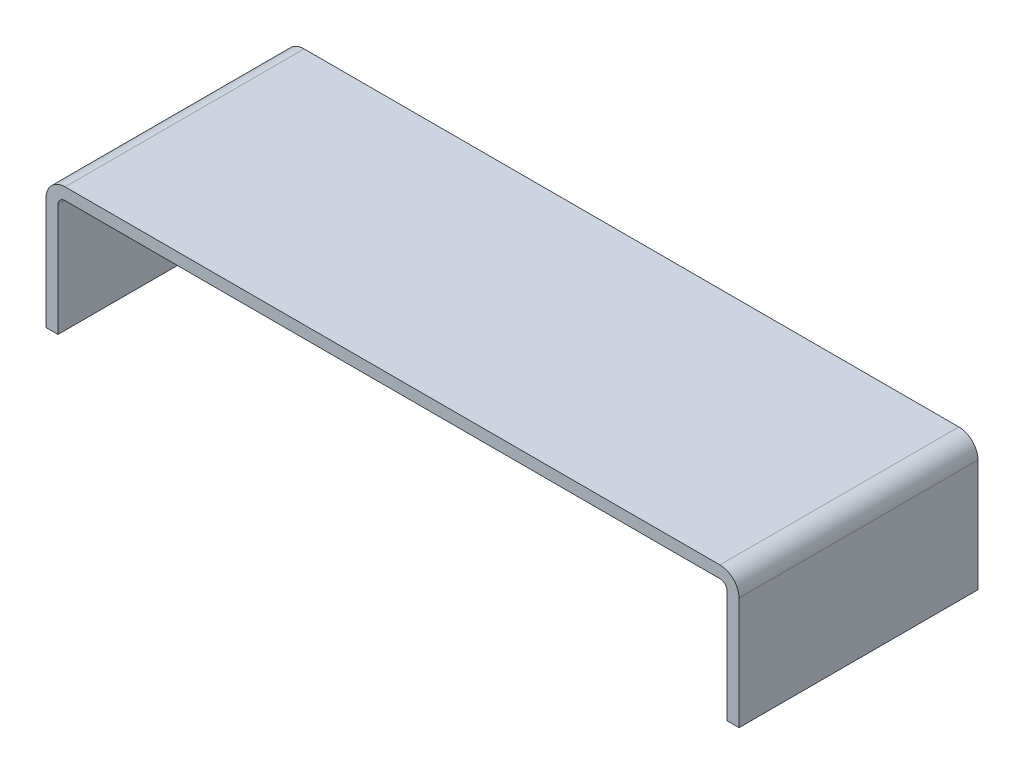
ISO-10303-21;
HEADER;
FILE_DESCRIPTION(('STEP AP214'),'2;1');
FILE_NAME('part.step','',(''),(''),'','','');
FILE_SCHEMA(('AUTOMOTIVE_DESIGN { 1 0 10303 214 1 1 1 1 }'));
ENDSEC;
DATA;
#1=APPLICATION_CONTEXT('core data for automotive mechanical design processes');
#2=APPLICATION_PROTOCOL_DEFINITION('international standard','automotive_design',2000,#1);
#3=PRODUCT_CONTEXT('',#1,'mechanical');
#4=PRODUCT('Part','Part','',(#3));
#5=PRODUCT_RELATED_PRODUCT_CATEGORY('part','',(#4));
#6=PRODUCT_DEFINITION_FORMATION('','',#4);
#7=PRODUCT_DEFINITION_CONTEXT('part definition',#1,'design');
#8=PRODUCT_DEFINITION('design','',#6,#7);
#9=PRODUCT_DEFINITION_SHAPE('','',#8);
#10=(LENGTH_UNIT() NAMED_UNIT(*) SI_UNIT(.MILLI.,.METRE.));
#11=(NAMED_UNIT(*) PLANE_ANGLE_UNIT() SI_UNIT($,.RADIAN.));
#12=(NAMED_UNIT(*) SI_UNIT($,.STERADIAN.) SOLID_ANGLE_UNIT());
#13=UNCERTAINTY_MEASURE_WITH_UNIT(LENGTH_MEASURE(1.E-05),#10,'distance_accuracy_value','');
#14=(GEOMETRIC_REPRESENTATION_CONTEXT(3) GLOBAL_UNCERTAINTY_ASSIGNED_CONTEXT((#13)) GLOBAL_UNIT_ASSIGNED_CONTEXT((#10,
#11,#12)) REPRESENTATION_CONTEXT('',''));
#15=CARTESIAN_POINT('',(0.,0.,0.));
#16=DIRECTION('',(0.,0.,1.));
#17=DIRECTION('',(1.,0.,0.));
#18=AXIS2_PLACEMENT_3D('',#15,#16,#17);
#19=CARTESIAN_POINT('',(35.56,-0.762,12.7));
#20=DIRECTION('',(1.,0.,0.));
#21=DIRECTION('',(0.,1.,0.));
#22=AXIS2_PLACEMENT_3D('',#19,#20,#21);
#23=PLANE('',#22);
#24=DIRECTION('',(0.,-1.,0.));
#25=VECTOR('',#24,1.);
#26=CARTESIAN_POINT('',(35.56,-0.762,-12.7));
#27=LINE('',#26,#25);
#28=CARTESIAN_POINT('',(35.56,-0.762,-12.7));
#29=VERTEX_POINT('',#28);
#30=CARTESIAN_POINT('',(35.56,-12.7,-12.7));
#31=VERTEX_POINT('',#30);
#32=EDGE_CURVE('E153',#29,#31,#27,.T.);
#33=ORIENTED_EDGE('',*,*,#32,.T.);
#34=DIRECTION('',(0.,0.,-1.));
#35=VECTOR('',#34,1.);
#36=CARTESIAN_POINT('',(35.56,-12.7,12.7));
#37=LINE('',#36,#35);
#38=CARTESIAN_POINT('',(35.56,-12.7,12.7));
#39=VERTEX_POINT('',#38);
#40=EDGE_CURVE('E11',#39,#31,#37,.T.);
#41=ORIENTED_EDGE('',*,*,#40,.F.);
#42=DIRECTION('',(0.,-1.,0.));
#43=VECTOR('',#42,1.);
#44=CARTESIAN_POINT('',(35.56,-0.762,12.7));
#45=LINE('',#44,#43);
#46=CARTESIAN_POINT('',(35.56,-0.762,12.7));
#47=VERTEX_POINT('',#46);
#48=EDGE_CURVE('E101',#47,#39,#45,.T.);
#49=ORIENTED_EDGE('',*,*,#48,.F.);
#50=DIRECTION('',(0.,0.,-1.));
#51=VECTOR('',#50,1.);
#52=CARTESIAN_POINT('',(35.56,-0.762,12.7));
#53=LINE('',#52,#51);
#54=EDGE_CURVE('E149',#47,#29,#53,.T.);
#55=ORIENTED_EDGE('',*,*,#54,.T.);
#56=EDGE_LOOP('',(#33,#41,#49,#55));
#57=FACE_BOUND('',#56,.T.);
#58=ADVANCED_FACE('F33',(#57),#23,.F.);
#59=CARTESIAN_POINT('',(36.83,-12.7,12.7));
#60=DIRECTION('',(0.,-1.,0.));
#61=DIRECTION('',(0.,0.,-1.));
#62=AXIS2_PLACEMENT_3D('',#59,#60,#61);
#63=PLANE('',#62);
#64=DIRECTION('',(-1.,0.,0.));
#65=VECTOR('',#64,1.);
#66=CARTESIAN_POINT('',(36.83,-12.7,-12.7));
#67=LINE('',#66,#65);
#68=CARTESIAN_POINT('',(36.83,-12.7,-12.7));
#69=VERTEX_POINT('',#68);
#70=EDGE_CURVE('E156',#69,#31,#67,.T.);
#71=ORIENTED_EDGE('',*,*,#70,.F.);
#72=DIRECTION('',(0.,0.,-1.));
#73=VECTOR('',#72,1.);
#74=CARTESIAN_POINT('',(36.83,-12.7,12.7));
#75=LINE('',#74,#73);
#76=CARTESIAN_POINT('',(36.83,-12.7,12.7));
#77=VERTEX_POINT('',#76);
#78=EDGE_CURVE('E41',#77,#69,#75,.T.);
#79=ORIENTED_EDGE('',*,*,#78,.F.);
#80=DIRECTION('',(-1.,0.,0.));
#81=VECTOR('',#80,1.);
#82=CARTESIAN_POINT('',(36.83,-12.7,12.7));
#83=LINE('',#82,#81);
#84=EDGE_CURVE('E218',#77,#39,#83,.T.);
#85=ORIENTED_EDGE('',*,*,#84,.T.);
#86=ORIENTED_EDGE('',*,*,#40,.T.);
#87=EDGE_LOOP('',(#71,#79,#85,#86));
#88=FACE_BOUND('',#87,.T.);
#89=ADVANCED_FACE('F205',(#88),#63,.T.);
#90=CARTESIAN_POINT('',(36.83,-0.762000000000001,12.7));
#91=DIRECTION('',(1.,0.,0.));
#92=DIRECTION('',(0.,1.,0.));
#93=AXIS2_PLACEMENT_3D('',#90,#91,#92);
#94=PLANE('',#93);
#95=DIRECTION('',(0.,-1.,0.));
#96=VECTOR('',#95,1.);
#97=CARTESIAN_POINT('',(36.83,-0.762000000000001,-12.7));
#98=LINE('',#97,#96);
#99=CARTESIAN_POINT('',(36.83,-0.762000000000001,-12.7));
#100=VERTEX_POINT('',#99);
#101=EDGE_CURVE('E159',#100,#69,#98,.T.);
#102=ORIENTED_EDGE('',*,*,#101,.F.);
#103=DIRECTION('',(0.,0.,-1.));
#104=VECTOR('',#103,1.);
#105=CARTESIAN_POINT('',(36.83,-0.762000000000001,12.7));
#106=LINE('',#105,#104);
#107=CARTESIAN_POINT('',(36.83,-0.762000000000001,12.7));
#108=VERTEX_POINT('',#107);
#109=EDGE_CURVE('E195',#108,#100,#106,.T.);
#110=ORIENTED_EDGE('',*,*,#109,.F.);
#111=DIRECTION('',(0.,-1.,0.));
#112=VECTOR('',#111,1.);
#113=CARTESIAN_POINT('',(36.83,-0.762000000000001,12.7));
#114=LINE('',#113,#112);
#115=EDGE_CURVE('E202',#108,#77,#114,.T.);
#116=ORIENTED_EDGE('',*,*,#115,.T.);
#117=ORIENTED_EDGE('',*,*,#78,.T.);
#118=EDGE_LOOP('',(#102,#110,#116,#117));
#119=FACE_BOUND('',#118,.T.);
#120=ADVANCED_FACE('F200',(#119),#94,.T.);
#121=CARTESIAN_POINT('',(34.798,-0.762,12.7));
#122=DIRECTION('',(0.,0.,-1.));
#123=DIRECTION('',(-1.,0.,0.));
#124=AXIS2_PLACEMENT_3D('',#121,#122,#123);
#125=CYLINDRICAL_SURFACE('',#124,2.03200000000001);
#126=CARTESIAN_POINT('',(34.798,-0.762,-12.7));
#127=DIRECTION('',(0.,0.,1.));
#128=DIRECTION('',(1.,0.,0.));
#129=AXIS2_PLACEMENT_3D('',#126,#127,#128);
#130=CIRCLE('',#129,2.03200000000001);
#131=CARTESIAN_POINT('',(34.798,1.27000000000001,-12.7));
#132=VERTEX_POINT('',#131);
#133=EDGE_CURVE('E162',#132,#100,#130,.F.);
#134=ORIENTED_EDGE('',*,*,#133,.F.);
#135=DIRECTION('',(0.,0.,-1.));
#136=VECTOR('',#135,1.);
#137=CARTESIAN_POINT('',(34.798,1.27000000000001,12.7));
#138=LINE('',#137,#136);
#139=CARTESIAN_POINT('',(34.798,1.27000000000001,12.7));
#140=VERTEX_POINT('',#139);
#141=EDGE_CURVE('E193',#140,#132,#138,.T.);
#142=ORIENTED_EDGE('',*,*,#141,.F.);
#143=CARTESIAN_POINT('',(34.798,-0.762,12.7));
#144=DIRECTION('',(0.,0.,1.));
#145=DIRECTION('',(1.,0.,0.));
#146=AXIS2_PLACEMENT_3D('',#143,#144,#145);
#147=CIRCLE('',#146,2.03200000000001);
#148=EDGE_CURVE('E215',#140,#108,#147,.F.);
#149=ORIENTED_EDGE('',*,*,#148,.T.);
#150=ORIENTED_EDGE('',*,*,#109,.T.);
#151=EDGE_LOOP('',(#134,#142,#149,#150));
#152=FACE_BOUND('',#151,.T.);
#153=ADVANCED_FACE('F212',(#152),#125,.T.);
#154=CARTESIAN_POINT('',(-34.798,1.27,12.7));
#155=DIRECTION('',(0.,1.,0.));
#156=DIRECTION('',(-1.,0.,0.));
#157=AXIS2_PLACEMENT_3D('',#154,#155,#156);
#158=PLANE('',#157);
#159=DIRECTION('',(1.,0.,0.));
#160=VECTOR('',#159,1.);
#161=CARTESIAN_POINT('',(-34.798,1.27,-12.7));
#162=LINE('',#161,#160);
#163=CARTESIAN_POINT('',(-34.798,1.27,-12.7));
#164=VERTEX_POINT('',#163);
#165=EDGE_CURVE('E165',#164,#132,#162,.T.);
#166=ORIENTED_EDGE('',*,*,#165,.F.);
#167=DIRECTION('',(0.,0.,-1.));
#168=VECTOR('',#167,1.);
#169=CARTESIAN_POINT('',(-34.798,1.27,12.7));
#170=LINE('',#169,#168);
#171=CARTESIAN_POINT('',(-34.798,1.27,12.7));
#172=VERTEX_POINT('',#171);
#173=EDGE_CURVE('E191',#172,#164,#170,.T.);
#174=ORIENTED_EDGE('',*,*,#173,.F.);
#175=DIRECTION('',(1.,0.,0.));
#176=VECTOR('',#175,1.);
#177=CARTESIAN_POINT('',(-34.798,1.27,12.7));
#178=LINE('',#177,#176);
#179=EDGE_CURVE('E220',#172,#140,#178,.T.);
#180=ORIENTED_EDGE('',*,*,#179,.T.);
#181=ORIENTED_EDGE('',*,*,#141,.T.);
#182=EDGE_LOOP('',(#166,#174,#180,#181));
#183=FACE_BOUND('',#182,.T.);
#184=ADVANCED_FACE('F320',(#183),#158,.T.);
#185=CARTESIAN_POINT('',(-34.798,-0.762000000000013,12.7));
#186=DIRECTION('',(0.,0.,-1.));
#187=DIRECTION('',(-1.,0.,0.));
#188=AXIS2_PLACEMENT_3D('',#185,#186,#187);
#189=CYLINDRICAL_SURFACE('',#188,2.03200000000001);
#190=CARTESIAN_POINT('',(-34.798,-0.762000000000013,-12.7));
#191=DIRECTION('',(0.,0.,1.));
#192=DIRECTION('',(1.,0.,0.));
#193=AXIS2_PLACEMENT_3D('',#190,#191,#192);
#194=CIRCLE('',#193,2.03200000000001);
#195=CARTESIAN_POINT('',(-36.83,-0.762000000000013,-12.7));
#196=VERTEX_POINT('',#195);
#197=EDGE_CURVE('E168',#196,#164,#194,.F.);
#198=ORIENTED_EDGE('',*,*,#197,.F.);
#199=DIRECTION('',(0.,0.,-1.));
#200=VECTOR('',#199,1.);
#201=CARTESIAN_POINT('',(-36.83,-0.762000000000013,12.7));
#202=LINE('',#201,#200);
#203=CARTESIAN_POINT('',(-36.83,-0.762000000000013,12.7));
#204=VERTEX_POINT('',#203);
#205=EDGE_CURVE('E189',#204,#196,#202,.T.);
#206=ORIENTED_EDGE('',*,*,#205,.F.);
#207=CARTESIAN_POINT('',(-34.798,-0.762000000000013,12.7));
#208=DIRECTION('',(0.,0.,1.));
#209=DIRECTION('',(1.,0.,0.));
#210=AXIS2_PLACEMENT_3D('',#207,#208,#209);
#211=CIRCLE('',#210,2.03200000000001);
#212=EDGE_CURVE('E226',#204,#172,#211,.F.);
#213=ORIENTED_EDGE('',*,*,#212,.T.);
#214=ORIENTED_EDGE('',*,*,#173,.T.);
#215=EDGE_LOOP('',(#198,#206,#213,#214));
#216=FACE_BOUND('',#215,.T.);
#217=ADVANCED_FACE('F311',(#216),#189,.T.);
#218=CARTESIAN_POINT('',(-36.83,-12.7,12.7));
#219=DIRECTION('',(-1.,0.,0.));
#220=DIRECTION('',(0.,0.,1.));
#221=AXIS2_PLACEMENT_3D('',#218,#219,#220);
#222=PLANE('',#221);
#223=DIRECTION('',(0.,1.,0.));
#224=VECTOR('',#223,1.);
#225=CARTESIAN_POINT('',(-36.83,-12.7,-12.7));
#226=LINE('',#225,#224);
#227=CARTESIAN_POINT('',(-36.83,-12.7,-12.7));
#228=VERTEX_POINT('',#227);
#229=EDGE_CURVE('E171',#228,#196,#226,.T.);
#230=ORIENTED_EDGE('',*,*,#229,.F.);
#231=DIRECTION('',(0.,0.,-1.));
#232=VECTOR('',#231,1.);
#233=CARTESIAN_POINT('',(-36.83,-12.7,12.7));
#234=LINE('',#233,#232);
#235=CARTESIAN_POINT('',(-36.83,-12.7,12.7));
#236=VERTEX_POINT('',#235);
#237=EDGE_CURVE('E187',#236,#228,#234,.T.);
#238=ORIENTED_EDGE('',*,*,#237,.F.);
#239=DIRECTION('',(0.,1.,0.));
#240=VECTOR('',#239,1.);
#241=CARTESIAN_POINT('',(-36.83,-12.7,12.7));
#242=LINE('',#241,#240);
#243=EDGE_CURVE('E229',#236,#204,#242,.T.);
#244=ORIENTED_EDGE('',*,*,#243,.T.);
#245=ORIENTED_EDGE('',*,*,#205,.T.);
#246=EDGE_LOOP('',(#230,#238,#244,#245));
#247=FACE_BOUND('',#246,.T.);
#248=ADVANCED_FACE('F241',(#247),#222,.T.);
#249=CARTESIAN_POINT('',(-35.56,-12.7,12.7));
#250=DIRECTION('',(0.,-1.,0.));
#251=DIRECTION('',(0.,0.,-1.));
#252=AXIS2_PLACEMENT_3D('',#249,#250,#251);
#253=PLANE('',#252);
#254=DIRECTION('',(-1.,0.,0.));
#255=VECTOR('',#254,1.);
#256=CARTESIAN_POINT('',(-35.56,-12.7,-12.7));
#257=LINE('',#256,#255);
#258=CARTESIAN_POINT('',(-35.56,-12.7,-12.7));
#259=VERTEX_POINT('',#258);
#260=EDGE_CURVE('E174',#259,#228,#257,.T.);
#261=ORIENTED_EDGE('',*,*,#260,.F.);
#262=DIRECTION('',(0.,0.,-1.));
#263=VECTOR('',#262,1.);
#264=CARTESIAN_POINT('',(-35.56,-12.7,12.7));
#265=LINE('',#264,#263);
#266=CARTESIAN_POINT('',(-35.56,-12.7,12.7));
#267=VERTEX_POINT('',#266);
#268=EDGE_CURVE('E185',#267,#259,#265,.T.);
#269=ORIENTED_EDGE('',*,*,#268,.F.);
#270=DIRECTION('',(-1.,0.,0.));
#271=VECTOR('',#270,1.);
#272=CARTESIAN_POINT('',(-35.56,-12.7,12.7));
#273=LINE('',#272,#271);
#274=EDGE_CURVE('E232',#267,#236,#273,.T.);
#275=ORIENTED_EDGE('',*,*,#274,.T.);
#276=ORIENTED_EDGE('',*,*,#237,.T.);
#277=EDGE_LOOP('',(#261,#269,#275,#276));
#278=FACE_BOUND('',#277,.T.);
#279=ADVANCED_FACE('F236',(#278),#253,.T.);
#280=CARTESIAN_POINT('',(-35.56,-12.7,12.7));
#281=DIRECTION('',(-1.,0.,0.));
#282=DIRECTION('',(0.,0.,1.));
#283=AXIS2_PLACEMENT_3D('',#280,#281,#282);
#284=PLANE('',#283);
#285=DIRECTION('',(0.,1.,0.));
#286=VECTOR('',#285,1.);
#287=CARTESIAN_POINT('',(-35.56,-12.7,-12.7));
#288=LINE('',#287,#286);
#289=CARTESIAN_POINT('',(-35.56,-0.762000000000013,-12.7));
#290=VERTEX_POINT('',#289);
#291=EDGE_CURVE('E177',#259,#290,#288,.T.);
#292=ORIENTED_EDGE('',*,*,#291,.T.);
#293=DIRECTION('',(0.,0.,-1.));
#294=VECTOR('',#293,1.);
#295=CARTESIAN_POINT('',(-35.56,-0.762000000000013,12.7));
#296=LINE('',#295,#294);
#297=CARTESIAN_POINT('',(-35.56,-0.762000000000013,12.7));
#298=VERTEX_POINT('',#297);
#299=EDGE_CURVE('E144',#298,#290,#296,.T.);
#300=ORIENTED_EDGE('',*,*,#299,.F.);
#301=DIRECTION('',(0.,1.,0.));
#302=VECTOR('',#301,1.);
#303=CARTESIAN_POINT('',(-35.56,-12.7,12.7));
#304=LINE('',#303,#302);
#305=EDGE_CURVE('E135',#267,#298,#304,.T.);
#306=ORIENTED_EDGE('',*,*,#305,.F.);
#307=ORIENTED_EDGE('',*,*,#268,.T.);
#308=EDGE_LOOP('',(#292,#300,#306,#307));
#309=FACE_BOUND('',#308,.T.);
#310=ADVANCED_FACE('F245',(#309),#284,.F.);
#311=CARTESIAN_POINT('',(-34.798,-0.762000000000013,12.7));
#312=DIRECTION('',(0.,0.,-1.));
#313=DIRECTION('',(-1.,0.,0.));
#314=AXIS2_PLACEMENT_3D('',#311,#312,#313);
#315=CYLINDRICAL_SURFACE('',#314,0.762000000000006);
#316=CARTESIAN_POINT('',(-34.798,-0.762000000000013,-12.7));
#317=DIRECTION('',(0.,0.,-1.));
#318=DIRECTION('',(-1.,0.,0.));
#319=AXIS2_PLACEMENT_3D('',#316,#317,#318);
#320=CIRCLE('',#319,0.762000000000006);
#321=CARTESIAN_POINT('',(-34.798,0.,-12.7));
#322=VERTEX_POINT('',#321);
#323=EDGE_CURVE('E143',#290,#322,#320,.T.);
#324=ORIENTED_EDGE('',*,*,#323,.T.);
#325=DIRECTION('',(0.,0.,-1.));
#326=VECTOR('',#325,1.);
#327=CARTESIAN_POINT('',(-34.798,0.,12.7));
#328=LINE('',#327,#326);
#329=CARTESIAN_POINT('',(-34.798,0.,12.7));
#330=VERTEX_POINT('',#329);
#331=EDGE_CURVE('E140',#330,#322,#328,.T.);
#332=ORIENTED_EDGE('',*,*,#331,.F.);
#333=CARTESIAN_POINT('',(-34.798,-0.762000000000013,12.7));
#334=DIRECTION('',(0.,0.,-1.));
#335=DIRECTION('',(-1.,0.,0.));
#336=AXIS2_PLACEMENT_3D('',#333,#334,#335);
#337=CIRCLE('',#336,0.762000000000006);
#338=EDGE_CURVE('E128',#298,#330,#337,.T.);
#339=ORIENTED_EDGE('',*,*,#338,.F.);
#340=ORIENTED_EDGE('',*,*,#299,.T.);
#341=EDGE_LOOP('',(#324,#332,#339,#340));
#342=FACE_BOUND('',#341,.T.);
#343=ADVANCED_FACE('F141',(#342),#315,.F.);
#344=CARTESIAN_POINT('',(-34.798,0.,12.7));
#345=DIRECTION('',(0.,1.,0.));
#346=DIRECTION('',(-1.,0.,0.));
#347=AXIS2_PLACEMENT_3D('',#344,#345,#346);
#348=PLANE('',#347);
#349=DIRECTION('',(1.,0.,0.));
#350=VECTOR('',#349,1.);
#351=CARTESIAN_POINT('',(-34.798,0.,-12.7));
#352=LINE('',#351,#350);
#353=CARTESIAN_POINT('',(34.798,0.,-12.7));
#354=VERTEX_POINT('',#353);
#355=EDGE_CURVE('E89',#322,#354,#352,.T.);
#356=ORIENTED_EDGE('',*,*,#355,.T.);
#357=DIRECTION('',(0.,0.,-1.));
#358=VECTOR('',#357,1.);
#359=CARTESIAN_POINT('',(34.798,0.,12.7));
#360=LINE('',#359,#358);
#361=CARTESIAN_POINT('',(34.798,0.,12.7));
#362=VERTEX_POINT('',#361);
#363=EDGE_CURVE('E145',#362,#354,#360,.T.);
#364=ORIENTED_EDGE('',*,*,#363,.F.);
#365=DIRECTION('',(1.,0.,0.));
#366=VECTOR('',#365,1.);
#367=CARTESIAN_POINT('',(-34.798,0.,12.7));
#368=LINE('',#367,#366);
#369=EDGE_CURVE('E132',#330,#362,#368,.T.);
#370=ORIENTED_EDGE('',*,*,#369,.F.);
#371=ORIENTED_EDGE('',*,*,#331,.T.);
#372=EDGE_LOOP('',(#356,#364,#370,#371));
#373=FACE_BOUND('',#372,.T.);
#374=ADVANCED_FACE('F147',(#373),#348,.F.);
#375=CARTESIAN_POINT('',(34.798,-0.762,12.7));
#376=DIRECTION('',(0.,0.,-1.));
#377=DIRECTION('',(-1.,0.,0.));
#378=AXIS2_PLACEMENT_3D('',#375,#376,#377);
#379=CYLINDRICAL_SURFACE('',#378,0.762000000000006);
#380=CARTESIAN_POINT('',(34.798,-0.762,-12.7));
#381=DIRECTION('',(0.,0.,-1.));
#382=DIRECTION('',(-1.,0.,0.));
#383=AXIS2_PLACEMENT_3D('',#380,#381,#382);
#384=CIRCLE('',#383,0.762000000000006);
#385=EDGE_CURVE('E95',#354,#29,#384,.T.);
#386=ORIENTED_EDGE('',*,*,#385,.T.);
#387=ORIENTED_EDGE('',*,*,#54,.F.);
#388=CARTESIAN_POINT('',(34.798,-0.762,12.7));
#389=DIRECTION('',(0.,0.,-1.));
#390=DIRECTION('',(-1.,0.,0.));
#391=AXIS2_PLACEMENT_3D('',#388,#389,#390);
#392=CIRCLE('',#391,0.762000000000006);
#393=EDGE_CURVE('E49',#362,#47,#392,.T.);
#394=ORIENTED_EDGE('',*,*,#393,.F.);
#395=ORIENTED_EDGE('',*,*,#363,.T.);
#396=EDGE_LOOP('',(#386,#387,#394,#395));
#397=FACE_BOUND('',#396,.T.);
#398=ADVANCED_FACE('F259',(#397),#379,.F.);
#399=CARTESIAN_POINT('',(34.798,-0.762,12.7));
#400=DIRECTION('',(0.,0.,1.));
#401=DIRECTION('',(1.,0.,0.));
#402=AXIS2_PLACEMENT_3D('',#399,#400,#401);
#403=PLANE('',#402);
#404=ORIENTED_EDGE('',*,*,#48,.T.);
#405=ORIENTED_EDGE('',*,*,#84,.F.);
#406=ORIENTED_EDGE('',*,*,#115,.F.);
#407=ORIENTED_EDGE('',*,*,#148,.F.);
#408=ORIENTED_EDGE('',*,*,#179,.F.);
#409=ORIENTED_EDGE('',*,*,#212,.F.);
#410=ORIENTED_EDGE('',*,*,#243,.F.);
#411=ORIENTED_EDGE('',*,*,#274,.F.);
#412=ORIENTED_EDGE('',*,*,#305,.T.);
#413=ORIENTED_EDGE('',*,*,#338,.T.);
#414=ORIENTED_EDGE('',*,*,#369,.T.);
#415=ORIENTED_EDGE('',*,*,#393,.T.);
#416=EDGE_LOOP('',(#404,#405,#406,#407,#408,#409,#410,#411,#412,#413,#414,#415));
#417=FACE_BOUND('',#416,.T.);
#418=ADVANCED_FACE('F130',(#417),#403,.T.);
#419=CARTESIAN_POINT('',(34.798,-0.762,-12.7));
#420=DIRECTION('',(0.,0.,1.));
#421=DIRECTION('',(1.,0.,0.));
#422=AXIS2_PLACEMENT_3D('',#419,#420,#421);
#423=PLANE('',#422);
#424=ORIENTED_EDGE('',*,*,#32,.F.);
#425=ORIENTED_EDGE('',*,*,#385,.F.);
#426=ORIENTED_EDGE('',*,*,#355,.F.);
#427=ORIENTED_EDGE('',*,*,#323,.F.);
#428=ORIENTED_EDGE('',*,*,#291,.F.);
#429=ORIENTED_EDGE('',*,*,#260,.T.);
#430=ORIENTED_EDGE('',*,*,#229,.T.);
#431=ORIENTED_EDGE('',*,*,#197,.T.);
#432=ORIENTED_EDGE('',*,*,#165,.T.);
#433=ORIENTED_EDGE('',*,*,#133,.T.);
#434=ORIENTED_EDGE('',*,*,#101,.T.);
#435=ORIENTED_EDGE('',*,*,#70,.T.);
#436=EDGE_LOOP('',(#424,#425,#426,#427,#428,#429,#430,#431,#432,#433,#434,#435));
#437=FACE_BOUND('',#436,.T.);
#438=ADVANCED_FACE('F208',(#437),#423,.F.);
#439=CLOSED_SHELL('',(#58,#89,#120,#153,#184,#217,#248,#279,#310,#343,#374,#398,#418,#438));
#440=MANIFOLD_SOLID_BREP('B2',#439);
#441=ADVANCED_BREP_SHAPE_REPRESENTATION('',(#18,#440),#14);
#442=SHAPE_DEFINITION_REPRESENTATION(#9,#441);
ENDSEC;
END-ISO-10303-21;
